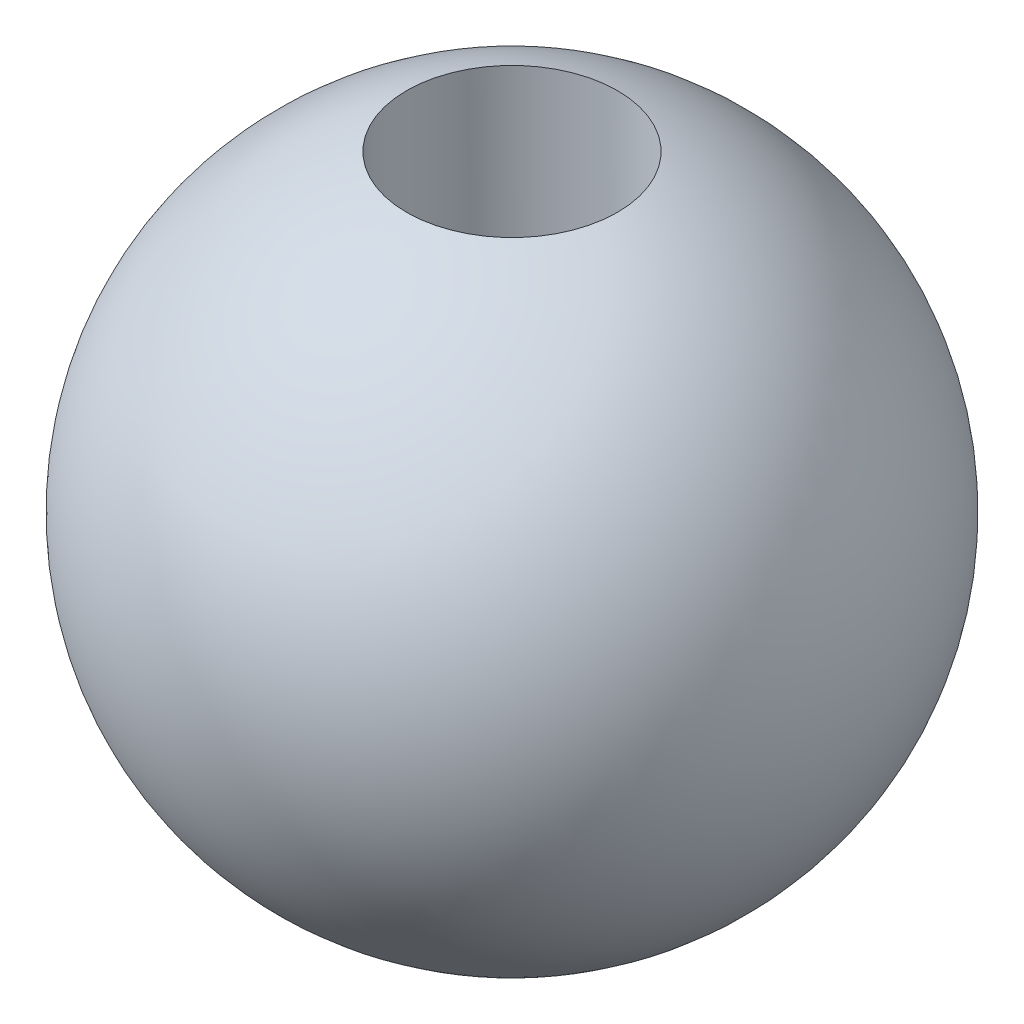
ISO-10303-21;
HEADER;
FILE_DESCRIPTION(('STEP AP214'),'2;1');
FILE_NAME('part.step','',(''),(''),'','','');
FILE_SCHEMA(('AUTOMOTIVE_DESIGN { 1 0 10303 214 1 1 1 1 }'));
ENDSEC;
DATA;
#1=APPLICATION_CONTEXT('core data for automotive mechanical design processes');
#2=APPLICATION_PROTOCOL_DEFINITION('international standard','automotive_design',2000,#1);
#3=PRODUCT_CONTEXT('',#1,'mechanical');
#4=PRODUCT('Part','Part','',(#3));
#5=PRODUCT_RELATED_PRODUCT_CATEGORY('part','',(#4));
#6=PRODUCT_DEFINITION_FORMATION('','',#4);
#7=PRODUCT_DEFINITION_CONTEXT('part definition',#1,'design');
#8=PRODUCT_DEFINITION('design','',#6,#7);
#9=PRODUCT_DEFINITION_SHAPE('','',#8);
#10=(LENGTH_UNIT() NAMED_UNIT(*) SI_UNIT(.MILLI.,.METRE.));
#11=(NAMED_UNIT(*) PLANE_ANGLE_UNIT() SI_UNIT($,.RADIAN.));
#12=(NAMED_UNIT(*) SI_UNIT($,.STERADIAN.) SOLID_ANGLE_UNIT());
#13=UNCERTAINTY_MEASURE_WITH_UNIT(LENGTH_MEASURE(1.E-05),#10,'distance_accuracy_value','');
#14=(GEOMETRIC_REPRESENTATION_CONTEXT(3) GLOBAL_UNCERTAINTY_ASSIGNED_CONTEXT((#13)) GLOBAL_UNIT_ASSIGNED_CONTEXT((#10,
#11,#12)) REPRESENTATION_CONTEXT('',''));
#15=CARTESIAN_POINT('',(0.,0.,0.));
#16=DIRECTION('',(0.,0.,1.));
#17=DIRECTION('',(1.,0.,0.));
#18=AXIS2_PLACEMENT_3D('',#15,#16,#17);
#19=CARTESIAN_POINT('',(0.,-20.,0.));
#20=DIRECTION('',(0.,1.,0.));
#21=DIRECTION('',(0.,0.,1.));
#22=AXIS2_PLACEMENT_3D('',#19,#20,#21);
#23=CYLINDRICAL_SURFACE('',#22,4.);
#24=CARTESIAN_POINT('',(0.,-11.842719282327,0.));
#25=DIRECTION('',(0.,1.,0.));
#26=DIRECTION('',(0.,0.,1.));
#27=AXIS2_PLACEMENT_3D('',#24,#25,#26);
#28=CIRCLE('',#27,4.);
#29=CARTESIAN_POINT('',(0.,-11.842719282327,4.));
#30=VERTEX_POINT('',#29);
#31=EDGE_CURVE('E47',#30,#30,#28,.F.);
#32=ORIENTED_EDGE('',*,*,#31,.T.);
#33=EDGE_LOOP('',(#32));
#34=FACE_BOUND('',#33,.T.);
#35=CARTESIAN_POINT('',(0.,-3.11159214520098,0.));
#36=DIRECTION('',(0.,-1.,0.));
#37=DIRECTION('',(0.,0.,-1.));
#38=AXIS2_PLACEMENT_3D('',#35,#36,#37);
#39=CIRCLE('',#38,4.);
#40=CARTESIAN_POINT('',(0.,-3.11159214520098,-4.));
#41=VERTEX_POINT('',#40);
#42=EDGE_CURVE('E10',#41,#41,#39,.T.);
#43=ORIENTED_EDGE('',*,*,#42,.F.);
#44=EDGE_LOOP('',(#43));
#45=FACE_BOUND('',#44,.T.);
#46=ADVANCED_FACE('F32',(#34,#45),#23,.F.);
#47=CARTESIAN_POINT('',(0.,11.842719282327,0.));
#48=DIRECTION('',(0.,-1.,0.));
#49=DIRECTION('',(0.,0.,-1.));
#50=AXIS2_PLACEMENT_3D('',#47,#48,#49);
#51=CIRCLE('',#50,4.);
#52=CARTESIAN_POINT('',(0.,11.842719282327,-4.));
#53=VERTEX_POINT('',#52);
#54=EDGE_CURVE('E43',#53,#53,#51,.F.);
#55=ORIENTED_EDGE('',*,*,#54,.T.);
#56=EDGE_LOOP('',(#55));
#57=FACE_BOUND('',#56,.T.);
#58=CARTESIAN_POINT('',(0.,3.11159214520098,0.));
#59=DIRECTION('',(0.,1.,0.));
#60=DIRECTION('',(0.,0.,1.));
#61=AXIS2_PLACEMENT_3D('',#58,#59,#60);
#62=CIRCLE('',#61,4.);
#63=CARTESIAN_POINT('',(0.,3.11159214520098,4.));
#64=VERTEX_POINT('',#63);
#65=EDGE_CURVE('E39',#64,#64,#62,.T.);
#66=ORIENTED_EDGE('',*,*,#65,.F.);
#67=EDGE_LOOP('',(#66));
#68=FACE_BOUND('',#67,.T.);
#69=ADVANCED_FACE('F72',(#57,#68),#23,.F.);
#70=CARTESIAN_POINT('',(0.,0.,0.));
#71=DIRECTION('',(0.,1.,0.));
#72=DIRECTION('',(1.,0.,0.));
#73=AXIS2_PLACEMENT_3D('',#70,#71,#72);
#74=SPHERICAL_SURFACE('',#73,12.5);
#75=ORIENTED_EDGE('',*,*,#54,.F.);
#76=EDGE_LOOP('',(#75));
#77=FACE_BOUND('',#76,.T.);
#78=ORIENTED_EDGE('',*,*,#31,.F.);
#79=EDGE_LOOP('',(#78));
#80=FACE_BOUND('',#79,.T.);
#81=ADVANCED_FACE('F34',(#77,#80),#74,.T.);
#82=CARTESIAN_POINT('',(0.,2.,0.));
#83=DIRECTION('',(0.,1.,0.));
#84=DIRECTION('',(0.,0.,1.));
#85=AXIS2_PLACEMENT_3D('',#82,#83,#84);
#86=CONICAL_SURFACE('',#85,2.15,1.02974425867666);
#87=CARTESIAN_POINT('',(0.,2.,0.));
#88=DIRECTION('',(0.,-1.,0.));
#89=DIRECTION('',(0.,0.,-1.));
#90=AXIS2_PLACEMENT_3D('',#87,#88,#89);
#91=CIRCLE('',#90,2.15);
#92=CARTESIAN_POINT('',(0.,2.,-2.15));
#93=VERTEX_POINT('',#92);
#94=EDGE_CURVE('E52',#93,#93,#91,.T.);
#95=ORIENTED_EDGE('',*,*,#94,.T.);
#96=EDGE_LOOP('',(#95));
#97=FACE_BOUND('',#96,.T.);
#98=ORIENTED_EDGE('',*,*,#65,.T.);
#99=EDGE_LOOP('',(#98));
#100=FACE_BOUND('',#99,.T.);
#101=ADVANCED_FACE('F67',(#97,#100),#86,.F.);
#102=CARTESIAN_POINT('',(0.,0.,0.));
#103=DIRECTION('',(0.,-1.,0.));
#104=DIRECTION('',(0.,0.,-1.));
#105=AXIS2_PLACEMENT_3D('',#102,#103,#104);
#106=CYLINDRICAL_SURFACE('',#105,2.15);
#107=ORIENTED_EDGE('',*,*,#94,.F.);
#108=EDGE_LOOP('',(#107));
#109=FACE_BOUND('',#108,.T.);
#110=CARTESIAN_POINT('',(0.,-2.,0.));
#111=DIRECTION('',(0.,-1.,0.));
#112=DIRECTION('',(0.,0.,-1.));
#113=AXIS2_PLACEMENT_3D('',#110,#111,#112);
#114=CIRCLE('',#113,2.15);
#115=CARTESIAN_POINT('',(0.,-2.,-2.15));
#116=VERTEX_POINT('',#115);
#117=EDGE_CURVE('E55',#116,#116,#114,.T.);
#118=ORIENTED_EDGE('',*,*,#117,.T.);
#119=EDGE_LOOP('',(#118));
#120=FACE_BOUND('',#119,.T.);
#121=ADVANCED_FACE('F59',(#109,#120),#106,.F.);
#122=CARTESIAN_POINT('',(0.,-2.,0.));
#123=DIRECTION('',(0.,-1.,0.));
#124=DIRECTION('',(0.,0.,1.));
#125=AXIS2_PLACEMENT_3D('',#122,#123,#124);
#126=CONICAL_SURFACE('',#125,2.15,1.02974425867666);
#127=ORIENTED_EDGE('',*,*,#117,.F.);
#128=EDGE_LOOP('',(#127));
#129=FACE_BOUND('',#128,.T.);
#130=ORIENTED_EDGE('',*,*,#42,.T.);
#131=EDGE_LOOP('',(#130));
#132=FACE_BOUND('',#131,.T.);
#133=ADVANCED_FACE('F61',(#129,#132),#126,.F.);
#134=CLOSED_SHELL('',(#46,#69,#81,#101,#121,#133));
#135=MANIFOLD_SOLID_BREP('B2',#134);
#136=ADVANCED_BREP_SHAPE_REPRESENTATION('',(#18,#135),#14);
#137=SHAPE_DEFINITION_REPRESENTATION(#9,#136);
ENDSEC;
END-ISO-10303-21;
